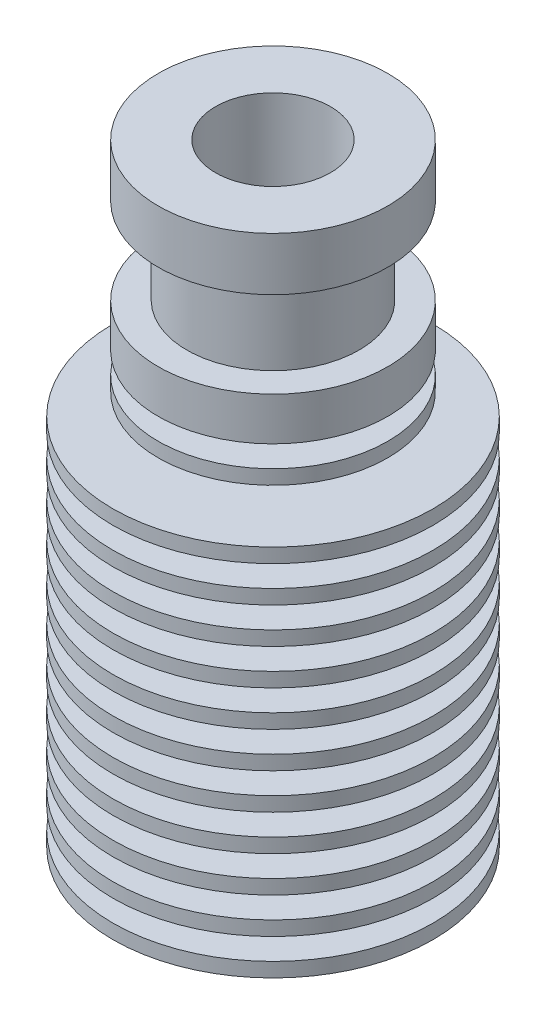
ISO-10303-21;
HEADER;
FILE_DESCRIPTION(('STEP AP214'),'2;1');
FILE_NAME('part.step','',(''),(''),'','','');
FILE_SCHEMA(('AUTOMOTIVE_DESIGN { 1 0 10303 214 1 1 1 1 }'));
ENDSEC;
DATA;
#1=APPLICATION_CONTEXT('core data for automotive mechanical design processes');
#2=APPLICATION_PROTOCOL_DEFINITION('international standard','automotive_design',2000,#1);
#3=PRODUCT_CONTEXT('',#1,'mechanical');
#4=PRODUCT('Part','Part','',(#3));
#5=PRODUCT_RELATED_PRODUCT_CATEGORY('part','',(#4));
#6=PRODUCT_DEFINITION_FORMATION('','',#4);
#7=PRODUCT_DEFINITION_CONTEXT('part definition',#1,'design');
#8=PRODUCT_DEFINITION('design','',#6,#7);
#9=PRODUCT_DEFINITION_SHAPE('','',#8);
#10=(LENGTH_UNIT() NAMED_UNIT(*) SI_UNIT(.MILLI.,.METRE.));
#11=(NAMED_UNIT(*) PLANE_ANGLE_UNIT() SI_UNIT($,.RADIAN.));
#12=(NAMED_UNIT(*) SI_UNIT($,.STERADIAN.) SOLID_ANGLE_UNIT());
#13=UNCERTAINTY_MEASURE_WITH_UNIT(LENGTH_MEASURE(1.E-05),#10,'distance_accuracy_value','');
#14=(GEOMETRIC_REPRESENTATION_CONTEXT(3) GLOBAL_UNCERTAINTY_ASSIGNED_CONTEXT((#13)) GLOBAL_UNIT_ASSIGNED_CONTEXT((#10,
#11,#12)) REPRESENTATION_CONTEXT('',''));
#15=CARTESIAN_POINT('',(0.,0.,0.));
#16=DIRECTION('',(0.,0.,1.));
#17=DIRECTION('',(1.,0.,0.));
#18=AXIS2_PLACEMENT_3D('',#15,#16,#17);
#19=CARTESIAN_POINT('',(-11.2838,17.5,11.2838));
#20=DIRECTION('',(0.,-1.,0.));
#21=DIRECTION('',(0.,0.,-1.));
#22=AXIS2_PLACEMENT_3D('',#19,#20,#21);
#23=PLANE('',#22);
#24=CARTESIAN_POINT('',(0.,17.5,0.));
#25=DIRECTION('',(0.,-1.,0.));
#26=DIRECTION('',(0.,0.,-1.));
#27=AXIS2_PLACEMENT_3D('',#24,#25,#26);
#28=CIRCLE('',#27,5.213883311);
#29=CARTESIAN_POINT('',(0.,17.5,-5.213883311));
#30=VERTEX_POINT('',#29);
#31=EDGE_CURVE('E195',#30,#30,#28,.F.);
#32=ORIENTED_EDGE('',*,*,#31,.T.);
#33=EDGE_LOOP('',(#32));
#34=FACE_BOUND('',#33,.T.);
#35=CARTESIAN_POINT('',(0.,17.5,0.));
#36=DIRECTION('',(0.,-1.,0.));
#37=DIRECTION('',(1.,0.,0.));
#38=AXIS2_PLACEMENT_3D('',#35,#36,#37);
#39=CIRCLE('',#38,11.15);
#40=CARTESIAN_POINT('',(11.15,17.5,0.));
#41=VERTEX_POINT('',#40);
#42=EDGE_CURVE('E18',#41,#41,#39,.T.);
#43=ORIENTED_EDGE('',*,*,#42,.T.);
#44=EDGE_LOOP('',(#43));
#45=FACE_BOUND('',#44,.T.);
#46=ADVANCED_FACE('F14',(#34,#45),#23,.T.);
#47=CARTESIAN_POINT('',(0.,18.5,0.));
#48=DIRECTION('',(0.,-1.,0.));
#49=DIRECTION('',(1.,0.,0.));
#50=AXIS2_PLACEMENT_3D('',#47,#48,#49);
#51=CYLINDRICAL_SURFACE('',#50,11.15);
#52=CARTESIAN_POINT('',(0.,18.5,0.));
#53=DIRECTION('',(0.,-1.,0.));
#54=DIRECTION('',(1.,0.,0.));
#55=AXIS2_PLACEMENT_3D('',#52,#53,#54);
#56=CIRCLE('',#55,11.15);
#57=CARTESIAN_POINT('',(11.15,18.5,0.));
#58=VERTEX_POINT('',#57);
#59=EDGE_CURVE('E193',#58,#58,#56,.F.);
#60=ORIENTED_EDGE('',*,*,#59,.F.);
#61=EDGE_LOOP('',(#60));
#62=FACE_BOUND('',#61,.T.);
#63=ORIENTED_EDGE('',*,*,#42,.F.);
#64=EDGE_LOOP('',(#63));
#65=FACE_BOUND('',#64,.T.);
#66=ADVANCED_FACE('F203',(#62,#65),#51,.T.);
#67=CARTESIAN_POINT('',(0.,17.5,0.));
#68=DIRECTION('',(0.,-1.,0.));
#69=DIRECTION('',(0.,0.,-1.));
#70=AXIS2_PLACEMENT_3D('',#67,#68,#69);
#71=CYLINDRICAL_SURFACE('',#70,5.213883311);
#72=ORIENTED_EDGE('',*,*,#31,.F.);
#73=EDGE_LOOP('',(#72));
#74=FACE_BOUND('',#73,.T.);
#75=CARTESIAN_POINT('',(0.,16.,0.));
#76=DIRECTION('',(0.,-1.,0.));
#77=DIRECTION('',(0.,0.,-1.));
#78=AXIS2_PLACEMENT_3D('',#75,#76,#77);
#79=CIRCLE('',#78,5.213883311);
#80=CARTESIAN_POINT('',(0.,16.,-5.213883311));
#81=VERTEX_POINT('',#80);
#82=EDGE_CURVE('E190',#81,#81,#79,.T.);
#83=ORIENTED_EDGE('',*,*,#82,.F.);
#84=EDGE_LOOP('',(#83));
#85=FACE_BOUND('',#84,.T.);
#86=ADVANCED_FACE('F205',(#74,#85),#71,.T.);
#87=CARTESIAN_POINT('',(-11.2838,18.5,-11.2838));
#88=DIRECTION('',(0.,1.,0.));
#89=DIRECTION('',(0.,0.,1.));
#90=AXIS2_PLACEMENT_3D('',#87,#88,#89);
#91=PLANE('',#90);
#92=CARTESIAN_POINT('',(0.,18.5,0.));
#93=DIRECTION('',(0.,-1.,0.));
#94=DIRECTION('',(1.,0.,0.));
#95=AXIS2_PLACEMENT_3D('',#92,#93,#94);
#96=CIRCLE('',#95,5.082863863);
#97=CARTESIAN_POINT('',(5.082863863,18.5,0.));
#98=VERTEX_POINT('',#97);
#99=EDGE_CURVE('E187',#98,#98,#96,.T.);
#100=ORIENTED_EDGE('',*,*,#99,.T.);
#101=EDGE_LOOP('',(#100));
#102=FACE_BOUND('',#101,.T.);
#103=ORIENTED_EDGE('',*,*,#59,.T.);
#104=EDGE_LOOP('',(#103));
#105=FACE_BOUND('',#104,.T.);
#106=ADVANCED_FACE('F213',(#102,#105),#91,.T.);
#107=CARTESIAN_POINT('',(-11.2838,16.,-11.2838));
#108=DIRECTION('',(0.,1.,0.));
#109=DIRECTION('',(0.,0.,1.));
#110=AXIS2_PLACEMENT_3D('',#107,#108,#109);
#111=PLANE('',#110);
#112=ORIENTED_EDGE('',*,*,#82,.T.);
#113=EDGE_LOOP('',(#112));
#114=FACE_BOUND('',#113,.T.);
#115=CARTESIAN_POINT('',(0.,16.,0.));
#116=DIRECTION('',(0.,-1.,0.));
#117=DIRECTION('',(0.,0.,-1.));
#118=AXIS2_PLACEMENT_3D('',#115,#116,#117);
#119=CIRCLE('',#118,11.15);
#120=CARTESIAN_POINT('',(0.,16.,-11.15));
#121=VERTEX_POINT('',#120);
#122=EDGE_CURVE('E184',#121,#121,#119,.F.);
#123=ORIENTED_EDGE('',*,*,#122,.T.);
#124=EDGE_LOOP('',(#123));
#125=FACE_BOUND('',#124,.T.);
#126=ADVANCED_FACE('F363',(#114,#125),#111,.T.);
#127=CARTESIAN_POINT('',(0.,20.,0.));
#128=DIRECTION('',(0.,-1.,0.));
#129=DIRECTION('',(1.,0.,0.));
#130=AXIS2_PLACEMENT_3D('',#127,#128,#129);
#131=CYLINDRICAL_SURFACE('',#130,5.082863863);
#132=CARTESIAN_POINT('',(0.,20.,0.));
#133=DIRECTION('',(0.,-1.,0.));
#134=DIRECTION('',(1.,0.,0.));
#135=AXIS2_PLACEMENT_3D('',#132,#133,#134);
#136=CIRCLE('',#135,5.082863863);
#137=CARTESIAN_POINT('',(5.082863863,20.,0.));
#138=VERTEX_POINT('',#137);
#139=EDGE_CURVE('E181',#138,#138,#136,.F.);
#140=ORIENTED_EDGE('',*,*,#139,.F.);
#141=EDGE_LOOP('',(#140));
#142=FACE_BOUND('',#141,.T.);
#143=ORIENTED_EDGE('',*,*,#99,.F.);
#144=EDGE_LOOP('',(#143));
#145=FACE_BOUND('',#144,.T.);
#146=ADVANCED_FACE('F360',(#142,#145),#131,.T.);
#147=CARTESIAN_POINT('',(0.,16.,0.));
#148=DIRECTION('',(0.,-1.,0.));
#149=DIRECTION('',(0.,0.,-1.));
#150=AXIS2_PLACEMENT_3D('',#147,#148,#149);
#151=CYLINDRICAL_SURFACE('',#150,11.15);
#152=ORIENTED_EDGE('',*,*,#122,.F.);
#153=EDGE_LOOP('',(#152));
#154=FACE_BOUND('',#153,.T.);
#155=CARTESIAN_POINT('',(0.,15.,0.));
#156=DIRECTION('',(0.,-1.,0.));
#157=DIRECTION('',(0.,0.,-1.));
#158=AXIS2_PLACEMENT_3D('',#155,#156,#157);
#159=CIRCLE('',#158,11.15);
#160=CARTESIAN_POINT('',(0.,15.,-11.15));
#161=VERTEX_POINT('',#160);
#162=EDGE_CURVE('E178',#161,#161,#159,.T.);
#163=ORIENTED_EDGE('',*,*,#162,.F.);
#164=EDGE_LOOP('',(#163));
#165=FACE_BOUND('',#164,.T.);
#166=ADVANCED_FACE('F356',(#154,#165),#151,.T.);
#167=CARTESIAN_POINT('',(-11.2838,20.,11.2838));
#168=DIRECTION('',(0.,-1.,0.));
#169=DIRECTION('',(0.,0.,-1.));
#170=AXIS2_PLACEMENT_3D('',#167,#168,#169);
#171=PLANE('',#170);
#172=ORIENTED_EDGE('',*,*,#139,.T.);
#173=EDGE_LOOP('',(#172));
#174=FACE_BOUND('',#173,.T.);
#175=CARTESIAN_POINT('',(0.,20.,0.));
#176=DIRECTION('',(0.,-1.,0.));
#177=DIRECTION('',(0.,0.,-1.));
#178=AXIS2_PLACEMENT_3D('',#175,#176,#177);
#179=CIRCLE('',#178,11.15);
#180=CARTESIAN_POINT('',(0.,20.,-11.15));
#181=VERTEX_POINT('',#180);
#182=EDGE_CURVE('E175',#181,#181,#179,.T.);
#183=ORIENTED_EDGE('',*,*,#182,.T.);
#184=EDGE_LOOP('',(#183));
#185=FACE_BOUND('',#184,.T.);
#186=ADVANCED_FACE('F359',(#174,#185),#171,.T.);
#187=CARTESIAN_POINT('',(-11.2838,15.,11.2838));
#188=DIRECTION('',(0.,-1.,0.));
#189=DIRECTION('',(0.,0.,-1.));
#190=AXIS2_PLACEMENT_3D('',#187,#188,#189);
#191=PLANE('',#190);
#192=CARTESIAN_POINT('',(0.,15.,0.));
#193=DIRECTION('',(0.,-1.,0.));
#194=DIRECTION('',(1.,0.,0.));
#195=AXIS2_PLACEMENT_3D('',#192,#193,#194);
#196=CIRCLE('',#195,5.344902759);
#197=CARTESIAN_POINT('',(5.344902759,15.,0.));
#198=VERTEX_POINT('',#197);
#199=EDGE_CURVE('E172',#198,#198,#196,.F.);
#200=ORIENTED_EDGE('',*,*,#199,.T.);
#201=EDGE_LOOP('',(#200));
#202=FACE_BOUND('',#201,.T.);
#203=ORIENTED_EDGE('',*,*,#162,.T.);
#204=EDGE_LOOP('',(#203));
#205=FACE_BOUND('',#204,.T.);
#206=ADVANCED_FACE('F354',(#202,#205),#191,.T.);
#207=CARTESIAN_POINT('',(0.,21.,0.));
#208=DIRECTION('',(0.,-1.,0.));
#209=DIRECTION('',(0.,0.,-1.));
#210=AXIS2_PLACEMENT_3D('',#207,#208,#209);
#211=CYLINDRICAL_SURFACE('',#210,11.15);
#212=CARTESIAN_POINT('',(0.,21.,0.));
#213=DIRECTION('',(0.,-1.,0.));
#214=DIRECTION('',(0.,0.,-1.));
#215=AXIS2_PLACEMENT_3D('',#212,#213,#214);
#216=CIRCLE('',#215,11.15);
#217=CARTESIAN_POINT('',(0.,21.,-11.15));
#218=VERTEX_POINT('',#217);
#219=EDGE_CURVE('E169',#218,#218,#216,.F.);
#220=ORIENTED_EDGE('',*,*,#219,.F.);
#221=EDGE_LOOP('',(#220));
#222=FACE_BOUND('',#221,.T.);
#223=ORIENTED_EDGE('',*,*,#182,.F.);
#224=EDGE_LOOP('',(#223));
#225=FACE_BOUND('',#224,.T.);
#226=ADVANCED_FACE('F350',(#222,#225),#211,.T.);
#227=CARTESIAN_POINT('',(0.,15.,0.));
#228=DIRECTION('',(0.,-1.,0.));
#229=DIRECTION('',(1.,0.,0.));
#230=AXIS2_PLACEMENT_3D('',#227,#228,#229);
#231=CYLINDRICAL_SURFACE('',#230,5.344902759);
#232=ORIENTED_EDGE('',*,*,#199,.F.);
#233=EDGE_LOOP('',(#232));
#234=FACE_BOUND('',#233,.T.);
#235=CARTESIAN_POINT('',(0.,13.5,0.));
#236=DIRECTION('',(0.,-1.,0.));
#237=DIRECTION('',(1.,0.,0.));
#238=AXIS2_PLACEMENT_3D('',#235,#236,#237);
#239=CIRCLE('',#238,5.344902759);
#240=CARTESIAN_POINT('',(5.344902759,13.5,0.));
#241=VERTEX_POINT('',#240);
#242=EDGE_CURVE('E166',#241,#241,#239,.T.);
#243=ORIENTED_EDGE('',*,*,#242,.F.);
#244=EDGE_LOOP('',(#243));
#245=FACE_BOUND('',#244,.T.);
#246=ADVANCED_FACE('F346',(#234,#245),#231,.T.);
#247=CARTESIAN_POINT('',(-11.2838,21.,-11.2838));
#248=DIRECTION('',(0.,1.,0.));
#249=DIRECTION('',(0.,0.,1.));
#250=AXIS2_PLACEMENT_3D('',#247,#248,#249);
#251=PLANE('',#250);
#252=CARTESIAN_POINT('',(0.,21.,0.));
#253=DIRECTION('',(0.,-1.,0.));
#254=DIRECTION('',(0.,0.,-1.));
#255=AXIS2_PLACEMENT_3D('',#252,#253,#254);
#256=CIRCLE('',#255,4.951844414);
#257=CARTESIAN_POINT('',(0.,21.,-4.951844414));
#258=VERTEX_POINT('',#257);
#259=EDGE_CURVE('E163',#258,#258,#256,.T.);
#260=ORIENTED_EDGE('',*,*,#259,.T.);
#261=EDGE_LOOP('',(#260));
#262=FACE_BOUND('',#261,.T.);
#263=ORIENTED_EDGE('',*,*,#219,.T.);
#264=EDGE_LOOP('',(#263));
#265=FACE_BOUND('',#264,.T.);
#266=ADVANCED_FACE('F349',(#262,#265),#251,.T.);
#267=CARTESIAN_POINT('',(-11.2838,13.5,-11.2838));
#268=DIRECTION('',(0.,1.,0.));
#269=DIRECTION('',(0.,0.,1.));
#270=AXIS2_PLACEMENT_3D('',#267,#268,#269);
#271=PLANE('',#270);
#272=ORIENTED_EDGE('',*,*,#242,.T.);
#273=EDGE_LOOP('',(#272));
#274=FACE_BOUND('',#273,.T.);
#275=CARTESIAN_POINT('',(0.,13.5,0.));
#276=DIRECTION('',(0.,-1.,0.));
#277=DIRECTION('',(1.,0.,0.));
#278=AXIS2_PLACEMENT_3D('',#275,#276,#277);
#279=CIRCLE('',#278,11.15);
#280=CARTESIAN_POINT('',(11.15,13.5,0.));
#281=VERTEX_POINT('',#280);
#282=EDGE_CURVE('E160',#281,#281,#279,.F.);
#283=ORIENTED_EDGE('',*,*,#282,.T.);
#284=EDGE_LOOP('',(#283));
#285=FACE_BOUND('',#284,.T.);
#286=ADVANCED_FACE('F344',(#274,#285),#271,.T.);
#287=CARTESIAN_POINT('',(0.,22.5,0.));
#288=DIRECTION('',(0.,-1.,0.));
#289=DIRECTION('',(0.,0.,-1.));
#290=AXIS2_PLACEMENT_3D('',#287,#288,#289);
#291=CYLINDRICAL_SURFACE('',#290,4.951844414);
#292=CARTESIAN_POINT('',(0.,22.5,0.));
#293=DIRECTION('',(0.,-1.,0.));
#294=DIRECTION('',(0.,0.,-1.));
#295=AXIS2_PLACEMENT_3D('',#292,#293,#294);
#296=CIRCLE('',#295,4.951844414);
#297=CARTESIAN_POINT('',(0.,22.5,-4.951844414));
#298=VERTEX_POINT('',#297);
#299=EDGE_CURVE('E157',#298,#298,#296,.F.);
#300=ORIENTED_EDGE('',*,*,#299,.F.);
#301=EDGE_LOOP('',(#300));
#302=FACE_BOUND('',#301,.T.);
#303=ORIENTED_EDGE('',*,*,#259,.F.);
#304=EDGE_LOOP('',(#303));
#305=FACE_BOUND('',#304,.T.);
#306=ADVANCED_FACE('F340',(#302,#305),#291,.T.);
#307=CARTESIAN_POINT('',(0.,13.5,0.));
#308=DIRECTION('',(0.,-1.,0.));
#309=DIRECTION('',(1.,0.,0.));
#310=AXIS2_PLACEMENT_3D('',#307,#308,#309);
#311=CYLINDRICAL_SURFACE('',#310,11.15);
#312=ORIENTED_EDGE('',*,*,#282,.F.);
#313=EDGE_LOOP('',(#312));
#314=FACE_BOUND('',#313,.T.);
#315=CARTESIAN_POINT('',(0.,12.5,0.));
#316=DIRECTION('',(0.,-1.,0.));
#317=DIRECTION('',(1.,0.,0.));
#318=AXIS2_PLACEMENT_3D('',#315,#316,#317);
#319=CIRCLE('',#318,11.15);
#320=CARTESIAN_POINT('',(11.15,12.5,0.));
#321=VERTEX_POINT('',#320);
#322=EDGE_CURVE('E154',#321,#321,#319,.T.);
#323=ORIENTED_EDGE('',*,*,#322,.F.);
#324=EDGE_LOOP('',(#323));
#325=FACE_BOUND('',#324,.T.);
#326=ADVANCED_FACE('F336',(#314,#325),#311,.T.);
#327=CARTESIAN_POINT('',(-11.2838,22.5,11.2838));
#328=DIRECTION('',(0.,-1.,0.));
#329=DIRECTION('',(0.,0.,-1.));
#330=AXIS2_PLACEMENT_3D('',#327,#328,#329);
#331=PLANE('',#330);
#332=ORIENTED_EDGE('',*,*,#299,.T.);
#333=EDGE_LOOP('',(#332));
#334=FACE_BOUND('',#333,.T.);
#335=CARTESIAN_POINT('',(0.,22.5,0.));
#336=DIRECTION('',(0.,-1.,0.));
#337=DIRECTION('',(0.,0.,-1.));
#338=AXIS2_PLACEMENT_3D('',#335,#336,#337);
#339=CIRCLE('',#338,11.15);
#340=CARTESIAN_POINT('',(0.,22.5,-11.15));
#341=VERTEX_POINT('',#340);
#342=EDGE_CURVE('E151',#341,#341,#339,.T.);
#343=ORIENTED_EDGE('',*,*,#342,.T.);
#344=EDGE_LOOP('',(#343));
#345=FACE_BOUND('',#344,.T.);
#346=ADVANCED_FACE('F339',(#334,#345),#331,.T.);
#347=CARTESIAN_POINT('',(-11.2838,12.5,11.2838));
#348=DIRECTION('',(0.,-1.,0.));
#349=DIRECTION('',(0.,0.,-1.));
#350=AXIS2_PLACEMENT_3D('',#347,#348,#349);
#351=PLANE('',#350);
#352=CARTESIAN_POINT('',(0.,12.5,0.));
#353=DIRECTION('',(0.,-1.,0.));
#354=DIRECTION('',(0.,0.,-1.));
#355=AXIS2_PLACEMENT_3D('',#352,#353,#354);
#356=CIRCLE('',#355,5.475922207);
#357=CARTESIAN_POINT('',(0.,12.5,-5.475922207));
#358=VERTEX_POINT('',#357);
#359=EDGE_CURVE('E148',#358,#358,#356,.F.);
#360=ORIENTED_EDGE('',*,*,#359,.T.);
#361=EDGE_LOOP('',(#360));
#362=FACE_BOUND('',#361,.T.);
#363=ORIENTED_EDGE('',*,*,#322,.T.);
#364=EDGE_LOOP('',(#363));
#365=FACE_BOUND('',#364,.T.);
#366=ADVANCED_FACE('F334',(#362,#365),#351,.T.);
#367=CARTESIAN_POINT('',(0.,23.5,0.));
#368=DIRECTION('',(0.,-1.,0.));
#369=DIRECTION('',(0.,0.,-1.));
#370=AXIS2_PLACEMENT_3D('',#367,#368,#369);
#371=CYLINDRICAL_SURFACE('',#370,11.15);
#372=CARTESIAN_POINT('',(0.,23.5,0.));
#373=DIRECTION('',(0.,-1.,0.));
#374=DIRECTION('',(0.,0.,-1.));
#375=AXIS2_PLACEMENT_3D('',#372,#373,#374);
#376=CIRCLE('',#375,11.15);
#377=CARTESIAN_POINT('',(0.,23.5,-11.15));
#378=VERTEX_POINT('',#377);
#379=EDGE_CURVE('E145',#378,#378,#376,.F.);
#380=ORIENTED_EDGE('',*,*,#379,.F.);
#381=EDGE_LOOP('',(#380));
#382=FACE_BOUND('',#381,.T.);
#383=ORIENTED_EDGE('',*,*,#342,.F.);
#384=EDGE_LOOP('',(#383));
#385=FACE_BOUND('',#384,.T.);
#386=ADVANCED_FACE('F330',(#382,#385),#371,.T.);
#387=CARTESIAN_POINT('',(0.,12.5,0.));
#388=DIRECTION('',(0.,-1.,0.));
#389=DIRECTION('',(0.,0.,-1.));
#390=AXIS2_PLACEMENT_3D('',#387,#388,#389);
#391=CYLINDRICAL_SURFACE('',#390,5.475922207);
#392=ORIENTED_EDGE('',*,*,#359,.F.);
#393=EDGE_LOOP('',(#392));
#394=FACE_BOUND('',#393,.T.);
#395=CARTESIAN_POINT('',(0.,11.,0.));
#396=DIRECTION('',(0.,-1.,0.));
#397=DIRECTION('',(0.,0.,-1.));
#398=AXIS2_PLACEMENT_3D('',#395,#396,#397);
#399=CIRCLE('',#398,5.475922207);
#400=CARTESIAN_POINT('',(0.,11.,-5.475922207));
#401=VERTEX_POINT('',#400);
#402=EDGE_CURVE('E142',#401,#401,#399,.T.);
#403=ORIENTED_EDGE('',*,*,#402,.F.);
#404=EDGE_LOOP('',(#403));
#405=FACE_BOUND('',#404,.T.);
#406=ADVANCED_FACE('F326',(#394,#405),#391,.T.);
#407=CARTESIAN_POINT('',(-11.2838,23.5,-11.2838));
#408=DIRECTION('',(0.,1.,0.));
#409=DIRECTION('',(0.,0.,1.));
#410=AXIS2_PLACEMENT_3D('',#407,#408,#409);
#411=PLANE('',#410);
#412=CARTESIAN_POINT('',(0.,23.5,0.));
#413=DIRECTION('',(0.,-1.,0.));
#414=DIRECTION('',(0.,0.,-1.));
#415=AXIS2_PLACEMENT_3D('',#412,#413,#414);
#416=CIRCLE('',#415,4.820824966);
#417=CARTESIAN_POINT('',(0.,23.5,-4.820824966));
#418=VERTEX_POINT('',#417);
#419=EDGE_CURVE('E139',#418,#418,#416,.T.);
#420=ORIENTED_EDGE('',*,*,#419,.T.);
#421=EDGE_LOOP('',(#420));
#422=FACE_BOUND('',#421,.T.);
#423=ORIENTED_EDGE('',*,*,#379,.T.);
#424=EDGE_LOOP('',(#423));
#425=FACE_BOUND('',#424,.T.);
#426=ADVANCED_FACE('F329',(#422,#425),#411,.T.);
#427=CARTESIAN_POINT('',(-11.2838,11.,-11.2838));
#428=DIRECTION('',(0.,1.,0.));
#429=DIRECTION('',(0.,0.,1.));
#430=AXIS2_PLACEMENT_3D('',#427,#428,#429);
#431=PLANE('',#430);
#432=ORIENTED_EDGE('',*,*,#402,.T.);
#433=EDGE_LOOP('',(#432));
#434=FACE_BOUND('',#433,.T.);
#435=CARTESIAN_POINT('',(0.,11.,0.));
#436=DIRECTION('',(0.,-1.,0.));
#437=DIRECTION('',(0.,0.,-1.));
#438=AXIS2_PLACEMENT_3D('',#435,#436,#437);
#439=CIRCLE('',#438,11.15);
#440=CARTESIAN_POINT('',(0.,11.,-11.15));
#441=VERTEX_POINT('',#440);
#442=EDGE_CURVE('E136',#441,#441,#439,.F.);
#443=ORIENTED_EDGE('',*,*,#442,.T.);
#444=EDGE_LOOP('',(#443));
#445=FACE_BOUND('',#444,.T.);
#446=ADVANCED_FACE('F324',(#434,#445),#431,.T.);
#447=CARTESIAN_POINT('',(0.,25.,0.));
#448=DIRECTION('',(0.,-1.,0.));
#449=DIRECTION('',(0.,0.,-1.));
#450=AXIS2_PLACEMENT_3D('',#447,#448,#449);
#451=CYLINDRICAL_SURFACE('',#450,4.820824966);
#452=CARTESIAN_POINT('',(0.,25.,0.));
#453=DIRECTION('',(0.,-1.,0.));
#454=DIRECTION('',(0.,0.,-1.));
#455=AXIS2_PLACEMENT_3D('',#452,#453,#454);
#456=CIRCLE('',#455,4.820824966);
#457=CARTESIAN_POINT('',(0.,25.,-4.820824966));
#458=VERTEX_POINT('',#457);
#459=EDGE_CURVE('E133',#458,#458,#456,.F.);
#460=ORIENTED_EDGE('',*,*,#459,.F.);
#461=EDGE_LOOP('',(#460));
#462=FACE_BOUND('',#461,.T.);
#463=ORIENTED_EDGE('',*,*,#419,.F.);
#464=EDGE_LOOP('',(#463));
#465=FACE_BOUND('',#464,.T.);
#466=ADVANCED_FACE('F320',(#462,#465),#451,.T.);
#467=CARTESIAN_POINT('',(0.,11.,0.));
#468=DIRECTION('',(0.,-1.,0.));
#469=DIRECTION('',(0.,0.,-1.));
#470=AXIS2_PLACEMENT_3D('',#467,#468,#469);
#471=CYLINDRICAL_SURFACE('',#470,11.15);
#472=ORIENTED_EDGE('',*,*,#442,.F.);
#473=EDGE_LOOP('',(#472));
#474=FACE_BOUND('',#473,.T.);
#475=CARTESIAN_POINT('',(0.,10.,0.));
#476=DIRECTION('',(0.,-1.,0.));
#477=DIRECTION('',(0.,0.,-1.));
#478=AXIS2_PLACEMENT_3D('',#475,#476,#477);
#479=CIRCLE('',#478,11.15);
#480=CARTESIAN_POINT('',(0.,10.,-11.15));
#481=VERTEX_POINT('',#480);
#482=EDGE_CURVE('E130',#481,#481,#479,.T.);
#483=ORIENTED_EDGE('',*,*,#482,.F.);
#484=EDGE_LOOP('',(#483));
#485=FACE_BOUND('',#484,.T.);
#486=ADVANCED_FACE('F316',(#474,#485),#471,.T.);
#487=CARTESIAN_POINT('',(-11.2838,25.,11.2838));
#488=DIRECTION('',(0.,-1.,0.));
#489=DIRECTION('',(0.,0.,-1.));
#490=AXIS2_PLACEMENT_3D('',#487,#488,#489);
#491=PLANE('',#490);
#492=ORIENTED_EDGE('',*,*,#459,.T.);
#493=EDGE_LOOP('',(#492));
#494=FACE_BOUND('',#493,.T.);
#495=CARTESIAN_POINT('',(0.,25.,0.));
#496=DIRECTION('',(0.,-1.,0.));
#497=DIRECTION('',(1.,0.,0.));
#498=AXIS2_PLACEMENT_3D('',#495,#496,#497);
#499=CIRCLE('',#498,11.15);
#500=CARTESIAN_POINT('',(11.15,25.,0.));
#501=VERTEX_POINT('',#500);
#502=EDGE_CURVE('E127',#501,#501,#499,.T.);
#503=ORIENTED_EDGE('',*,*,#502,.T.);
#504=EDGE_LOOP('',(#503));
#505=FACE_BOUND('',#504,.T.);
#506=ADVANCED_FACE('F319',(#494,#505),#491,.T.);
#507=CARTESIAN_POINT('',(-11.2838,10.,11.2838));
#508=DIRECTION('',(0.,-1.,0.));
#509=DIRECTION('',(0.,0.,-1.));
#510=AXIS2_PLACEMENT_3D('',#507,#508,#509);
#511=PLANE('',#510);
#512=CARTESIAN_POINT('',(0.,10.,0.));
#513=DIRECTION('',(0.,-1.,0.));
#514=DIRECTION('',(1.,0.,0.));
#515=AXIS2_PLACEMENT_3D('',#512,#513,#514);
#516=CIRCLE('',#515,5.606941655);
#517=CARTESIAN_POINT('',(5.606941655,10.,0.));
#518=VERTEX_POINT('',#517);
#519=EDGE_CURVE('E124',#518,#518,#516,.F.);
#520=ORIENTED_EDGE('',*,*,#519,.T.);
#521=EDGE_LOOP('',(#520));
#522=FACE_BOUND('',#521,.T.);
#523=ORIENTED_EDGE('',*,*,#482,.T.);
#524=EDGE_LOOP('',(#523));
#525=FACE_BOUND('',#524,.T.);
#526=ADVANCED_FACE('F314',(#522,#525),#511,.T.);
#527=CARTESIAN_POINT('',(0.,26.,0.));
#528=DIRECTION('',(0.,-1.,0.));
#529=DIRECTION('',(1.,0.,0.));
#530=AXIS2_PLACEMENT_3D('',#527,#528,#529);
#531=CYLINDRICAL_SURFACE('',#530,11.15);
#532=CARTESIAN_POINT('',(0.,26.,0.));
#533=DIRECTION('',(0.,-1.,0.));
#534=DIRECTION('',(1.,0.,0.));
#535=AXIS2_PLACEMENT_3D('',#532,#533,#534);
#536=CIRCLE('',#535,11.15);
#537=CARTESIAN_POINT('',(11.15,26.,0.));
#538=VERTEX_POINT('',#537);
#539=EDGE_CURVE('E121',#538,#538,#536,.F.);
#540=ORIENTED_EDGE('',*,*,#539,.F.);
#541=EDGE_LOOP('',(#540));
#542=FACE_BOUND('',#541,.T.);
#543=ORIENTED_EDGE('',*,*,#502,.F.);
#544=EDGE_LOOP('',(#543));
#545=FACE_BOUND('',#544,.T.);
#546=ADVANCED_FACE('F310',(#542,#545),#531,.T.);
#547=CARTESIAN_POINT('',(0.,10.,0.));
#548=DIRECTION('',(0.,-1.,0.));
#549=DIRECTION('',(1.,0.,0.));
#550=AXIS2_PLACEMENT_3D('',#547,#548,#549);
#551=CYLINDRICAL_SURFACE('',#550,5.606941655);
#552=ORIENTED_EDGE('',*,*,#519,.F.);
#553=EDGE_LOOP('',(#552));
#554=FACE_BOUND('',#553,.T.);
#555=CARTESIAN_POINT('',(0.,8.5,0.));
#556=DIRECTION('',(0.,-1.,0.));
#557=DIRECTION('',(1.,0.,0.));
#558=AXIS2_PLACEMENT_3D('',#555,#556,#557);
#559=CIRCLE('',#558,5.606941655);
#560=CARTESIAN_POINT('',(5.606941655,8.5,0.));
#561=VERTEX_POINT('',#560);
#562=EDGE_CURVE('E118',#561,#561,#559,.T.);
#563=ORIENTED_EDGE('',*,*,#562,.F.);
#564=EDGE_LOOP('',(#563));
#565=FACE_BOUND('',#564,.T.);
#566=ADVANCED_FACE('F306',(#554,#565),#551,.T.);
#567=CARTESIAN_POINT('',(-11.2838,26.,-11.2838));
#568=DIRECTION('',(0.,1.,0.));
#569=DIRECTION('',(0.,0.,1.));
#570=AXIS2_PLACEMENT_3D('',#567,#568,#569);
#571=PLANE('',#570);
#572=CARTESIAN_POINT('',(0.,26.,0.));
#573=DIRECTION('',(0.,-1.,0.));
#574=DIRECTION('',(0.,0.,-1.));
#575=AXIS2_PLACEMENT_3D('',#572,#573,#574);
#576=CIRCLE('',#575,4.689805518);
#577=CARTESIAN_POINT('',(0.,26.,-4.689805518));
#578=VERTEX_POINT('',#577);
#579=EDGE_CURVE('E115',#578,#578,#576,.T.);
#580=ORIENTED_EDGE('',*,*,#579,.T.);
#581=EDGE_LOOP('',(#580));
#582=FACE_BOUND('',#581,.T.);
#583=ORIENTED_EDGE('',*,*,#539,.T.);
#584=EDGE_LOOP('',(#583));
#585=FACE_BOUND('',#584,.T.);
#586=ADVANCED_FACE('F309',(#582,#585),#571,.T.);
#587=CARTESIAN_POINT('',(-11.2838,8.5,-11.2838));
#588=DIRECTION('',(0.,1.,0.));
#589=DIRECTION('',(0.,0.,1.));
#590=AXIS2_PLACEMENT_3D('',#587,#588,#589);
#591=PLANE('',#590);
#592=ORIENTED_EDGE('',*,*,#562,.T.);
#593=EDGE_LOOP('',(#592));
#594=FACE_BOUND('',#593,.T.);
#595=CARTESIAN_POINT('',(0.,8.5,0.));
#596=DIRECTION('',(0.,-1.,0.));
#597=DIRECTION('',(0.,0.,-1.));
#598=AXIS2_PLACEMENT_3D('',#595,#596,#597);
#599=CIRCLE('',#598,11.15);
#600=CARTESIAN_POINT('',(0.,8.5,-11.15));
#601=VERTEX_POINT('',#600);
#602=EDGE_CURVE('E112',#601,#601,#599,.F.);
#603=ORIENTED_EDGE('',*,*,#602,.T.);
#604=EDGE_LOOP('',(#603));
#605=FACE_BOUND('',#604,.T.);
#606=ADVANCED_FACE('F304',(#594,#605),#591,.T.);
#607=CARTESIAN_POINT('',(0.,27.5,0.));
#608=DIRECTION('',(0.,-1.,0.));
#609=DIRECTION('',(0.,0.,-1.));
#610=AXIS2_PLACEMENT_3D('',#607,#608,#609);
#611=CYLINDRICAL_SURFACE('',#610,4.689805518);
#612=CARTESIAN_POINT('',(0.,27.5,0.));
#613=DIRECTION('',(0.,-1.,0.));
#614=DIRECTION('',(0.,0.,-1.));
#615=AXIS2_PLACEMENT_3D('',#612,#613,#614);
#616=CIRCLE('',#615,4.689805518);
#617=CARTESIAN_POINT('',(0.,27.5,-4.689805518));
#618=VERTEX_POINT('',#617);
#619=EDGE_CURVE('E109',#618,#618,#616,.F.);
#620=ORIENTED_EDGE('',*,*,#619,.F.);
#621=EDGE_LOOP('',(#620));
#622=FACE_BOUND('',#621,.T.);
#623=ORIENTED_EDGE('',*,*,#579,.F.);
#624=EDGE_LOOP('',(#623));
#625=FACE_BOUND('',#624,.T.);
#626=ADVANCED_FACE('F300',(#622,#625),#611,.T.);
#627=CARTESIAN_POINT('',(0.,8.5,0.));
#628=DIRECTION('',(0.,-1.,0.));
#629=DIRECTION('',(0.,0.,-1.));
#630=AXIS2_PLACEMENT_3D('',#627,#628,#629);
#631=CYLINDRICAL_SURFACE('',#630,11.15);
#632=ORIENTED_EDGE('',*,*,#602,.F.);
#633=EDGE_LOOP('',(#632));
#634=FACE_BOUND('',#633,.T.);
#635=CARTESIAN_POINT('',(0.,7.5,0.));
#636=DIRECTION('',(0.,-1.,0.));
#637=DIRECTION('',(0.,0.,-1.));
#638=AXIS2_PLACEMENT_3D('',#635,#636,#637);
#639=CIRCLE('',#638,11.15);
#640=CARTESIAN_POINT('',(0.,7.5,-11.15));
#641=VERTEX_POINT('',#640);
#642=EDGE_CURVE('E106',#641,#641,#639,.T.);
#643=ORIENTED_EDGE('',*,*,#642,.F.);
#644=EDGE_LOOP('',(#643));
#645=FACE_BOUND('',#644,.T.);
#646=ADVANCED_FACE('F296',(#634,#645),#631,.T.);
#647=CARTESIAN_POINT('',(-8.096,27.5,8.096));
#648=DIRECTION('',(0.,-1.,0.));
#649=DIRECTION('',(0.,0.,-1.));
#650=AXIS2_PLACEMENT_3D('',#647,#648,#649);
#651=PLANE('',#650);
#652=ORIENTED_EDGE('',*,*,#619,.T.);
#653=EDGE_LOOP('',(#652));
#654=FACE_BOUND('',#653,.T.);
#655=CARTESIAN_POINT('',(0.,27.5,0.));
#656=DIRECTION('',(0.,-1.,0.));
#657=DIRECTION('',(1.,0.,0.));
#658=AXIS2_PLACEMENT_3D('',#655,#656,#657);
#659=CIRCLE('',#658,8.);
#660=CARTESIAN_POINT('',(8.,27.5,0.));
#661=VERTEX_POINT('',#660);
#662=EDGE_CURVE('E103',#661,#661,#659,.T.);
#663=ORIENTED_EDGE('',*,*,#662,.T.);
#664=EDGE_LOOP('',(#663));
#665=FACE_BOUND('',#664,.T.);
#666=ADVANCED_FACE('F299',(#654,#665),#651,.T.);
#667=CARTESIAN_POINT('',(-11.2838,7.5,11.2838));
#668=DIRECTION('',(0.,-1.,0.));
#669=DIRECTION('',(0.,0.,-1.));
#670=AXIS2_PLACEMENT_3D('',#667,#668,#669);
#671=PLANE('',#670);
#672=CARTESIAN_POINT('',(0.,7.5,0.));
#673=DIRECTION('',(0.,-1.,0.));
#674=DIRECTION('',(1.,0.,0.));
#675=AXIS2_PLACEMENT_3D('',#672,#673,#674);
#676=CIRCLE('',#675,5.737961104);
#677=CARTESIAN_POINT('',(5.737961104,7.5,0.));
#678=VERTEX_POINT('',#677);
#679=EDGE_CURVE('E100',#678,#678,#676,.F.);
#680=ORIENTED_EDGE('',*,*,#679,.T.);
#681=EDGE_LOOP('',(#680));
#682=FACE_BOUND('',#681,.T.);
#683=ORIENTED_EDGE('',*,*,#642,.T.);
#684=EDGE_LOOP('',(#683));
#685=FACE_BOUND('',#684,.T.);
#686=ADVANCED_FACE('F294',(#682,#685),#671,.T.);
#687=CARTESIAN_POINT('',(0.,28.5,0.));
#688=DIRECTION('',(0.,-1.,0.));
#689=DIRECTION('',(1.,0.,0.));
#690=AXIS2_PLACEMENT_3D('',#687,#688,#689);
#691=CYLINDRICAL_SURFACE('',#690,8.);
#692=CARTESIAN_POINT('',(0.,28.5,0.));
#693=DIRECTION('',(0.,-1.,0.));
#694=DIRECTION('',(1.,0.,0.));
#695=AXIS2_PLACEMENT_3D('',#692,#693,#694);
#696=CIRCLE('',#695,8.);
#697=CARTESIAN_POINT('',(8.,28.5,0.));
#698=VERTEX_POINT('',#697);
#699=EDGE_CURVE('E97',#698,#698,#696,.F.);
#700=ORIENTED_EDGE('',*,*,#699,.F.);
#701=EDGE_LOOP('',(#700));
#702=FACE_BOUND('',#701,.T.);
#703=ORIENTED_EDGE('',*,*,#662,.F.);
#704=EDGE_LOOP('',(#703));
#705=FACE_BOUND('',#704,.T.);
#706=ADVANCED_FACE('F290',(#702,#705),#691,.T.);
#707=CARTESIAN_POINT('',(0.,7.5,0.));
#708=DIRECTION('',(0.,-1.,0.));
#709=DIRECTION('',(1.,0.,0.));
#710=AXIS2_PLACEMENT_3D('',#707,#708,#709);
#711=CYLINDRICAL_SURFACE('',#710,5.737961104);
#712=ORIENTED_EDGE('',*,*,#679,.F.);
#713=EDGE_LOOP('',(#712));
#714=FACE_BOUND('',#713,.T.);
#715=CARTESIAN_POINT('',(0.,6.,0.));
#716=DIRECTION('',(0.,-1.,0.));
#717=DIRECTION('',(1.,0.,0.));
#718=AXIS2_PLACEMENT_3D('',#715,#716,#717);
#719=CIRCLE('',#718,5.737961104);
#720=CARTESIAN_POINT('',(5.737961104,6.,0.));
#721=VERTEX_POINT('',#720);
#722=EDGE_CURVE('E94',#721,#721,#719,.T.);
#723=ORIENTED_EDGE('',*,*,#722,.F.);
#724=EDGE_LOOP('',(#723));
#725=FACE_BOUND('',#724,.T.);
#726=ADVANCED_FACE('F286',(#714,#725),#711,.T.);
#727=CARTESIAN_POINT('',(-8.096,28.5,-8.096));
#728=DIRECTION('',(0.,1.,0.));
#729=DIRECTION('',(0.,0.,1.));
#730=AXIS2_PLACEMENT_3D('',#727,#728,#729);
#731=PLANE('',#730);
#732=CARTESIAN_POINT('',(0.,28.5,0.));
#733=DIRECTION('',(0.,-1.,0.));
#734=DIRECTION('',(1.,0.,0.));
#735=AXIS2_PLACEMENT_3D('',#732,#733,#734);
#736=CIRCLE('',#735,4.689805518);
#737=CARTESIAN_POINT('',(4.689805518,28.5,0.));
#738=VERTEX_POINT('',#737);
#739=EDGE_CURVE('E91',#738,#738,#736,.T.);
#740=ORIENTED_EDGE('',*,*,#739,.T.);
#741=EDGE_LOOP('',(#740));
#742=FACE_BOUND('',#741,.T.);
#743=ORIENTED_EDGE('',*,*,#699,.T.);
#744=EDGE_LOOP('',(#743));
#745=FACE_BOUND('',#744,.T.);
#746=ADVANCED_FACE('F289',(#742,#745),#731,.T.);
#747=CARTESIAN_POINT('',(-11.2838,6.,-11.2838));
#748=DIRECTION('',(0.,1.,0.));
#749=DIRECTION('',(0.,0.,1.));
#750=AXIS2_PLACEMENT_3D('',#747,#748,#749);
#751=PLANE('',#750);
#752=ORIENTED_EDGE('',*,*,#722,.T.);
#753=EDGE_LOOP('',(#752));
#754=FACE_BOUND('',#753,.T.);
#755=CARTESIAN_POINT('',(0.,6.,0.));
#756=DIRECTION('',(0.,-1.,0.));
#757=DIRECTION('',(0.,0.,-1.));
#758=AXIS2_PLACEMENT_3D('',#755,#756,#757);
#759=CIRCLE('',#758,11.15);
#760=CARTESIAN_POINT('',(0.,6.,-11.15));
#761=VERTEX_POINT('',#760);
#762=EDGE_CURVE('E88',#761,#761,#759,.F.);
#763=ORIENTED_EDGE('',*,*,#762,.T.);
#764=EDGE_LOOP('',(#763));
#765=FACE_BOUND('',#764,.T.);
#766=ADVANCED_FACE('F284',(#754,#765),#751,.T.);
#767=CARTESIAN_POINT('',(0.,30.,0.));
#768=DIRECTION('',(0.,-1.,0.));
#769=DIRECTION('',(1.,0.,0.));
#770=AXIS2_PLACEMENT_3D('',#767,#768,#769);
#771=CYLINDRICAL_SURFACE('',#770,4.689805518);
#772=CARTESIAN_POINT('',(0.,30.,0.));
#773=DIRECTION('',(0.,-1.,0.));
#774=DIRECTION('',(1.,0.,0.));
#775=AXIS2_PLACEMENT_3D('',#772,#773,#774);
#776=CIRCLE('',#775,4.689805518);
#777=CARTESIAN_POINT('',(4.689805518,30.,0.));
#778=VERTEX_POINT('',#777);
#779=EDGE_CURVE('E85',#778,#778,#776,.F.);
#780=ORIENTED_EDGE('',*,*,#779,.F.);
#781=EDGE_LOOP('',(#780));
#782=FACE_BOUND('',#781,.T.);
#783=ORIENTED_EDGE('',*,*,#739,.F.);
#784=EDGE_LOOP('',(#783));
#785=FACE_BOUND('',#784,.T.);
#786=ADVANCED_FACE('F280',(#782,#785),#771,.T.);
#787=CARTESIAN_POINT('',(0.,6.,0.));
#788=DIRECTION('',(0.,-1.,0.));
#789=DIRECTION('',(0.,0.,-1.));
#790=AXIS2_PLACEMENT_3D('',#787,#788,#789);
#791=CYLINDRICAL_SURFACE('',#790,11.15);
#792=ORIENTED_EDGE('',*,*,#762,.F.);
#793=EDGE_LOOP('',(#792));
#794=FACE_BOUND('',#793,.T.);
#795=CARTESIAN_POINT('',(0.,5.,0.));
#796=DIRECTION('',(0.,-1.,0.));
#797=DIRECTION('',(0.,0.,-1.));
#798=AXIS2_PLACEMENT_3D('',#795,#796,#797);
#799=CIRCLE('',#798,11.15);
#800=CARTESIAN_POINT('',(0.,5.,-11.15));
#801=VERTEX_POINT('',#800);
#802=EDGE_CURVE('E82',#801,#801,#799,.T.);
#803=ORIENTED_EDGE('',*,*,#802,.F.);
#804=EDGE_LOOP('',(#803));
#805=FACE_BOUND('',#804,.T.);
#806=ADVANCED_FACE('F276',(#794,#805),#791,.T.);
#807=CARTESIAN_POINT('',(-8.096,30.,8.096));
#808=DIRECTION('',(0.,-1.,0.));
#809=DIRECTION('',(0.,0.,-1.));
#810=AXIS2_PLACEMENT_3D('',#807,#808,#809);
#811=PLANE('',#810);
#812=ORIENTED_EDGE('',*,*,#779,.T.);
#813=EDGE_LOOP('',(#812));
#814=FACE_BOUND('',#813,.T.);
#815=CARTESIAN_POINT('',(0.,30.,0.));
#816=DIRECTION('',(0.,-1.,0.));
#817=DIRECTION('',(0.,0.,-1.));
#818=AXIS2_PLACEMENT_3D('',#815,#816,#817);
#819=CIRCLE('',#818,8.);
#820=CARTESIAN_POINT('',(0.,30.,-8.));
#821=VERTEX_POINT('',#820);
#822=EDGE_CURVE('E79',#821,#821,#819,.T.);
#823=ORIENTED_EDGE('',*,*,#822,.T.);
#824=EDGE_LOOP('',(#823));
#825=FACE_BOUND('',#824,.T.);
#826=ADVANCED_FACE('F279',(#814,#825),#811,.T.);
#827=CARTESIAN_POINT('',(-11.2838,5.,11.2838));
#828=DIRECTION('',(0.,-1.,0.));
#829=DIRECTION('',(0.,0.,-1.));
#830=AXIS2_PLACEMENT_3D('',#827,#828,#829);
#831=PLANE('',#830);
#832=CARTESIAN_POINT('',(0.,5.,0.));
#833=DIRECTION('',(0.,-1.,0.));
#834=DIRECTION('',(1.,0.,0.));
#835=AXIS2_PLACEMENT_3D('',#832,#833,#834);
#836=CIRCLE('',#835,5.868980552);
#837=CARTESIAN_POINT('',(5.868980552,5.,0.));
#838=VERTEX_POINT('',#837);
#839=EDGE_CURVE('E76',#838,#838,#836,.F.);
#840=ORIENTED_EDGE('',*,*,#839,.T.);
#841=EDGE_LOOP('',(#840));
#842=FACE_BOUND('',#841,.T.);
#843=ORIENTED_EDGE('',*,*,#802,.T.);
#844=EDGE_LOOP('',(#843));
#845=FACE_BOUND('',#844,.T.);
#846=ADVANCED_FACE('F274',(#842,#845),#831,.T.);
#847=CARTESIAN_POINT('',(0.,33.,0.));
#848=DIRECTION('',(0.,-1.,0.));
#849=DIRECTION('',(0.,0.,-1.));
#850=AXIS2_PLACEMENT_3D('',#847,#848,#849);
#851=CYLINDRICAL_SURFACE('',#850,8.);
#852=CARTESIAN_POINT('',(0.,33.,0.));
#853=DIRECTION('',(0.,-1.,0.));
#854=DIRECTION('',(0.,0.,-1.));
#855=AXIS2_PLACEMENT_3D('',#852,#853,#854);
#856=CIRCLE('',#855,8.);
#857=CARTESIAN_POINT('',(0.,33.,-8.));
#858=VERTEX_POINT('',#857);
#859=EDGE_CURVE('E73',#858,#858,#856,.F.);
#860=ORIENTED_EDGE('',*,*,#859,.F.);
#861=EDGE_LOOP('',(#860));
#862=FACE_BOUND('',#861,.T.);
#863=ORIENTED_EDGE('',*,*,#822,.F.);
#864=EDGE_LOOP('',(#863));
#865=FACE_BOUND('',#864,.T.);
#866=ADVANCED_FACE('F270',(#862,#865),#851,.T.);
#867=CARTESIAN_POINT('',(0.,5.,0.));
#868=DIRECTION('',(0.,-1.,0.));
#869=DIRECTION('',(1.,0.,0.));
#870=AXIS2_PLACEMENT_3D('',#867,#868,#869);
#871=CYLINDRICAL_SURFACE('',#870,5.868980552);
#872=ORIENTED_EDGE('',*,*,#839,.F.);
#873=EDGE_LOOP('',(#872));
#874=FACE_BOUND('',#873,.T.);
#875=CARTESIAN_POINT('',(0.,3.5,0.));
#876=DIRECTION('',(0.,-1.,0.));
#877=DIRECTION('',(1.,0.,0.));
#878=AXIS2_PLACEMENT_3D('',#875,#876,#877);
#879=CIRCLE('',#878,5.868980552);
#880=CARTESIAN_POINT('',(5.868980552,3.5,0.));
#881=VERTEX_POINT('',#880);
#882=EDGE_CURVE('E70',#881,#881,#879,.T.);
#883=ORIENTED_EDGE('',*,*,#882,.F.);
#884=EDGE_LOOP('',(#883));
#885=FACE_BOUND('',#884,.T.);
#886=ADVANCED_FACE('F266',(#874,#885),#871,.T.);
#887=CARTESIAN_POINT('',(-8.096,33.,-8.096));
#888=DIRECTION('',(0.,1.,0.));
#889=DIRECTION('',(0.,0.,1.));
#890=AXIS2_PLACEMENT_3D('',#887,#888,#889);
#891=PLANE('',#890);
#892=CARTESIAN_POINT('',(0.,33.,0.));
#893=DIRECTION('',(0.,-1.,0.));
#894=DIRECTION('',(0.,0.,-1.));
#895=AXIS2_PLACEMENT_3D('',#892,#893,#894);
#896=CIRCLE('',#895,6.);
#897=CARTESIAN_POINT('',(0.,33.,-6.));
#898=VERTEX_POINT('',#897);
#899=EDGE_CURVE('E67',#898,#898,#896,.T.);
#900=ORIENTED_EDGE('',*,*,#899,.T.);
#901=EDGE_LOOP('',(#900));
#902=FACE_BOUND('',#901,.T.);
#903=ORIENTED_EDGE('',*,*,#859,.T.);
#904=EDGE_LOOP('',(#903));
#905=FACE_BOUND('',#904,.T.);
#906=ADVANCED_FACE('F269',(#902,#905),#891,.T.);
#907=CARTESIAN_POINT('',(-11.2838,3.5,-11.2838));
#908=DIRECTION('',(0.,1.,0.));
#909=DIRECTION('',(0.,0.,1.));
#910=AXIS2_PLACEMENT_3D('',#907,#908,#909);
#911=PLANE('',#910);
#912=ORIENTED_EDGE('',*,*,#882,.T.);
#913=EDGE_LOOP('',(#912));
#914=FACE_BOUND('',#913,.T.);
#915=CARTESIAN_POINT('',(0.,3.5,0.));
#916=DIRECTION('',(0.,-1.,0.));
#917=DIRECTION('',(1.,0.,0.));
#918=AXIS2_PLACEMENT_3D('',#915,#916,#917);
#919=CIRCLE('',#918,11.15);
#920=CARTESIAN_POINT('',(11.15,3.5,0.));
#921=VERTEX_POINT('',#920);
#922=EDGE_CURVE('E64',#921,#921,#919,.F.);
#923=ORIENTED_EDGE('',*,*,#922,.T.);
#924=EDGE_LOOP('',(#923));
#925=FACE_BOUND('',#924,.T.);
#926=ADVANCED_FACE('F264',(#914,#925),#911,.T.);
#927=CARTESIAN_POINT('',(0.,39.,0.));
#928=DIRECTION('',(0.,-1.,0.));
#929=DIRECTION('',(0.,0.,-1.));
#930=AXIS2_PLACEMENT_3D('',#927,#928,#929);
#931=CYLINDRICAL_SURFACE('',#930,6.);
#932=CARTESIAN_POINT('',(0.,39.,0.));
#933=DIRECTION('',(0.,-1.,0.));
#934=DIRECTION('',(0.,0.,-1.));
#935=AXIS2_PLACEMENT_3D('',#932,#933,#934);
#936=CIRCLE('',#935,6.);
#937=CARTESIAN_POINT('',(0.,39.,-6.));
#938=VERTEX_POINT('',#937);
#939=EDGE_CURVE('E61',#938,#938,#936,.F.);
#940=ORIENTED_EDGE('',*,*,#939,.F.);
#941=EDGE_LOOP('',(#940));
#942=FACE_BOUND('',#941,.T.);
#943=ORIENTED_EDGE('',*,*,#899,.F.);
#944=EDGE_LOOP('',(#943));
#945=FACE_BOUND('',#944,.T.);
#946=ADVANCED_FACE('F260',(#942,#945),#931,.T.);
#947=CARTESIAN_POINT('',(0.,3.5,0.));
#948=DIRECTION('',(0.,-1.,0.));
#949=DIRECTION('',(1.,0.,0.));
#950=AXIS2_PLACEMENT_3D('',#947,#948,#949);
#951=CYLINDRICAL_SURFACE('',#950,11.15);
#952=ORIENTED_EDGE('',*,*,#922,.F.);
#953=EDGE_LOOP('',(#952));
#954=FACE_BOUND('',#953,.T.);
#955=CARTESIAN_POINT('',(0.,2.5,0.));
#956=DIRECTION('',(0.,-1.,0.));
#957=DIRECTION('',(1.,0.,0.));
#958=AXIS2_PLACEMENT_3D('',#955,#956,#957);
#959=CIRCLE('',#958,11.15);
#960=CARTESIAN_POINT('',(11.15,2.5,0.));
#961=VERTEX_POINT('',#960);
#962=EDGE_CURVE('E58',#961,#961,#959,.T.);
#963=ORIENTED_EDGE('',*,*,#962,.F.);
#964=EDGE_LOOP('',(#963));
#965=FACE_BOUND('',#964,.T.);
#966=ADVANCED_FACE('F256',(#954,#965),#951,.T.);
#967=CARTESIAN_POINT('',(-8.096,39.,8.096));
#968=DIRECTION('',(0.,-1.,0.));
#969=DIRECTION('',(0.,0.,-1.));
#970=AXIS2_PLACEMENT_3D('',#967,#968,#969);
#971=PLANE('',#970);
#972=ORIENTED_EDGE('',*,*,#939,.T.);
#973=EDGE_LOOP('',(#972));
#974=FACE_BOUND('',#973,.T.);
#975=CARTESIAN_POINT('',(0.,39.,0.));
#976=DIRECTION('',(0.,-1.,0.));
#977=DIRECTION('',(0.,0.,-1.));
#978=AXIS2_PLACEMENT_3D('',#975,#976,#977);
#979=CIRCLE('',#978,8.);
#980=CARTESIAN_POINT('',(0.,39.,-8.));
#981=VERTEX_POINT('',#980);
#982=EDGE_CURVE('E55',#981,#981,#979,.T.);
#983=ORIENTED_EDGE('',*,*,#982,.T.);
#984=EDGE_LOOP('',(#983));
#985=FACE_BOUND('',#984,.T.);
#986=ADVANCED_FACE('F259',(#974,#985),#971,.T.);
#987=CARTESIAN_POINT('',(-11.2838,2.5,11.2838));
#988=DIRECTION('',(0.,-1.,0.));
#989=DIRECTION('',(0.,0.,-1.));
#990=AXIS2_PLACEMENT_3D('',#987,#988,#989);
#991=PLANE('',#990);
#992=CARTESIAN_POINT('',(0.,2.5,0.));
#993=DIRECTION('',(0.,-1.,0.));
#994=DIRECTION('',(1.,0.,0.));
#995=AXIS2_PLACEMENT_3D('',#992,#993,#994);
#996=CIRCLE('',#995,6.);
#997=CARTESIAN_POINT('',(6.,2.5,0.));
#998=VERTEX_POINT('',#997);
#999=EDGE_CURVE('E52',#998,#998,#996,.F.);
#1000=ORIENTED_EDGE('',*,*,#999,.T.);
#1001=EDGE_LOOP('',(#1000));
#1002=FACE_BOUND('',#1001,.T.);
#1003=ORIENTED_EDGE('',*,*,#962,.T.);
#1004=EDGE_LOOP('',(#1003));
#1005=FACE_BOUND('',#1004,.T.);
#1006=ADVANCED_FACE('F254',(#1002,#1005),#991,.T.);
#1007=CARTESIAN_POINT('',(0.,42.7,0.));
#1008=DIRECTION('',(0.,-1.,0.));
#1009=DIRECTION('',(0.,0.,-1.));
#1010=AXIS2_PLACEMENT_3D('',#1007,#1008,#1009);
#1011=CYLINDRICAL_SURFACE('',#1010,8.);
#1012=CARTESIAN_POINT('',(0.,42.7,0.));
#1013=DIRECTION('',(0.,-1.,0.));
#1014=DIRECTION('',(0.,0.,-1.));
#1015=AXIS2_PLACEMENT_3D('',#1012,#1013,#1014);
#1016=CIRCLE('',#1015,8.);
#1017=CARTESIAN_POINT('',(0.,42.7,-8.));
#1018=VERTEX_POINT('',#1017);
#1019=EDGE_CURVE('E49',#1018,#1018,#1016,.F.);
#1020=ORIENTED_EDGE('',*,*,#1019,.F.);
#1021=EDGE_LOOP('',(#1020));
#1022=FACE_BOUND('',#1021,.T.);
#1023=ORIENTED_EDGE('',*,*,#982,.F.);
#1024=EDGE_LOOP('',(#1023));
#1025=FACE_BOUND('',#1024,.T.);
#1026=ADVANCED_FACE('F250',(#1022,#1025),#1011,.T.);
#1027=CARTESIAN_POINT('',(0.,2.5,0.));
#1028=DIRECTION('',(0.,-1.,0.));
#1029=DIRECTION('',(1.,0.,0.));
#1030=AXIS2_PLACEMENT_3D('',#1027,#1028,#1029);
#1031=CYLINDRICAL_SURFACE('',#1030,6.);
#1032=ORIENTED_EDGE('',*,*,#999,.F.);
#1033=EDGE_LOOP('',(#1032));
#1034=FACE_BOUND('',#1033,.T.);
#1035=CARTESIAN_POINT('',(0.,1.,0.));
#1036=DIRECTION('',(0.,-1.,0.));
#1037=DIRECTION('',(1.,0.,0.));
#1038=AXIS2_PLACEMENT_3D('',#1035,#1036,#1037);
#1039=CIRCLE('',#1038,6.);
#1040=CARTESIAN_POINT('',(6.,1.,0.));
#1041=VERTEX_POINT('',#1040);
#1042=EDGE_CURVE('E46',#1041,#1041,#1039,.T.);
#1043=ORIENTED_EDGE('',*,*,#1042,.F.);
#1044=EDGE_LOOP('',(#1043));
#1045=FACE_BOUND('',#1044,.T.);
#1046=ADVANCED_FACE('F246',(#1034,#1045),#1031,.T.);
#1047=CARTESIAN_POINT('',(-8.096,42.7,-8.096));
#1048=DIRECTION('',(0.,1.,0.));
#1049=DIRECTION('',(0.,0.,1.));
#1050=AXIS2_PLACEMENT_3D('',#1047,#1048,#1049);
#1051=PLANE('',#1050);
#1052=CARTESIAN_POINT('',(0.,42.7,0.));
#1053=DIRECTION('',(0.,-1.,0.));
#1054=DIRECTION('',(0.,0.,-1.));
#1055=AXIS2_PLACEMENT_3D('',#1052,#1053,#1054);
#1056=CIRCLE('',#1055,4.);
#1057=CARTESIAN_POINT('',(0.,42.7,-4.));
#1058=VERTEX_POINT('',#1057);
#1059=EDGE_CURVE('E43',#1058,#1058,#1056,.F.);
#1060=ORIENTED_EDGE('',*,*,#1059,.F.);
#1061=EDGE_LOOP('',(#1060));
#1062=FACE_BOUND('',#1061,.T.);
#1063=ORIENTED_EDGE('',*,*,#1019,.T.);
#1064=EDGE_LOOP('',(#1063));
#1065=FACE_BOUND('',#1064,.T.);
#1066=ADVANCED_FACE('F249',(#1062,#1065),#1051,.T.);
#1067=CARTESIAN_POINT('',(-11.2838,1.,-11.2838));
#1068=DIRECTION('',(0.,1.,0.));
#1069=DIRECTION('',(0.,0.,1.));
#1070=AXIS2_PLACEMENT_3D('',#1067,#1068,#1069);
#1071=PLANE('',#1070);
#1072=ORIENTED_EDGE('',*,*,#1042,.T.);
#1073=EDGE_LOOP('',(#1072));
#1074=FACE_BOUND('',#1073,.T.);
#1075=CARTESIAN_POINT('',(0.,1.,0.));
#1076=DIRECTION('',(0.,-1.,0.));
#1077=DIRECTION('',(0.,0.,-1.));
#1078=AXIS2_PLACEMENT_3D('',#1075,#1076,#1077);
#1079=CIRCLE('',#1078,11.15);
#1080=CARTESIAN_POINT('',(0.,1.,-11.15));
#1081=VERTEX_POINT('',#1080);
#1082=EDGE_CURVE('E36',#1081,#1081,#1079,.F.);
#1083=ORIENTED_EDGE('',*,*,#1082,.T.);
#1084=EDGE_LOOP('',(#1083));
#1085=FACE_BOUND('',#1084,.T.);
#1086=ADVANCED_FACE('F244',(#1074,#1085),#1071,.T.);
#1087=CARTESIAN_POINT('',(0.,42.7,0.));
#1088=DIRECTION('',(0.,-1.,0.));
#1089=DIRECTION('',(0.,0.,-1.));
#1090=AXIS2_PLACEMENT_3D('',#1087,#1088,#1089);
#1091=CYLINDRICAL_SURFACE('',#1090,4.);
#1092=CARTESIAN_POINT('',(0.,36.6,0.));
#1093=DIRECTION('',(0.,1.,0.));
#1094=DIRECTION('',(0.,0.,1.));
#1095=AXIS2_PLACEMENT_3D('',#1092,#1093,#1094);
#1096=CIRCLE('',#1095,4.);
#1097=CARTESIAN_POINT('',(0.,36.6,4.));
#1098=VERTEX_POINT('',#1097);
#1099=EDGE_CURVE('E32',#1098,#1098,#1096,.T.);
#1100=ORIENTED_EDGE('',*,*,#1099,.F.);
#1101=EDGE_LOOP('',(#1100));
#1102=FACE_BOUND('',#1101,.T.);
#1103=ORIENTED_EDGE('',*,*,#1059,.T.);
#1104=EDGE_LOOP('',(#1103));
#1105=FACE_BOUND('',#1104,.T.);
#1106=ADVANCED_FACE('F240',(#1102,#1105),#1091,.F.);
#1107=CARTESIAN_POINT('',(0.,1.,0.));
#1108=DIRECTION('',(0.,-1.,0.));
#1109=DIRECTION('',(0.,0.,-1.));
#1110=AXIS2_PLACEMENT_3D('',#1107,#1108,#1109);
#1111=CYLINDRICAL_SURFACE('',#1110,11.15);
#1112=ORIENTED_EDGE('',*,*,#1082,.F.);
#1113=EDGE_LOOP('',(#1112));
#1114=FACE_BOUND('',#1113,.T.);
#1115=CARTESIAN_POINT('',(0.,0.,0.));
#1116=DIRECTION('',(0.,-1.,0.));
#1117=DIRECTION('',(0.,0.,-1.));
#1118=AXIS2_PLACEMENT_3D('',#1115,#1116,#1117);
#1119=CIRCLE('',#1118,11.15);
#1120=CARTESIAN_POINT('',(0.,0.,-11.15));
#1121=VERTEX_POINT('',#1120);
#1122=EDGE_CURVE('E35',#1121,#1121,#1119,.T.);
#1123=ORIENTED_EDGE('',*,*,#1122,.F.);
#1124=EDGE_LOOP('',(#1123));
#1125=FACE_BOUND('',#1124,.T.);
#1126=ADVANCED_FACE('F236',(#1114,#1125),#1111,.T.);
#1127=CARTESIAN_POINT('',(0.,34.7,0.));
#1128=DIRECTION('',(0.,1.,0.));
#1129=DIRECTION('',(-1.,0.,0.));
#1130=AXIS2_PLACEMENT_3D('',#1127,#1128,#1129);
#1131=CONICAL_SURFACE('',#1130,2.1,0.785398163397449);
#1132=ORIENTED_EDGE('',*,*,#1099,.T.);
#1133=EDGE_LOOP('',(#1132));
#1134=FACE_BOUND('',#1133,.T.);
#1135=CARTESIAN_POINT('',(0.,34.7,0.));
#1136=DIRECTION('',(0.,1.,0.));
#1137=DIRECTION('',(0.,0.,1.));
#1138=AXIS2_PLACEMENT_3D('',#1135,#1136,#1137);
#1139=CIRCLE('',#1138,2.1);
#1140=CARTESIAN_POINT('',(0.,34.7,2.1));
#1141=VERTEX_POINT('',#1140);
#1142=EDGE_CURVE('E31',#1141,#1141,#1139,.T.);
#1143=ORIENTED_EDGE('',*,*,#1142,.F.);
#1144=EDGE_LOOP('',(#1143));
#1145=FACE_BOUND('',#1144,.T.);
#1146=ADVANCED_FACE('F233',(#1134,#1145),#1131,.F.);
#1147=CARTESIAN_POINT('',(-11.2838,0.,11.2838));
#1148=DIRECTION('',(0.,-1.,0.));
#1149=DIRECTION('',(0.,0.,-1.));
#1150=AXIS2_PLACEMENT_3D('',#1147,#1148,#1149);
#1151=PLANE('',#1150);
#1152=CARTESIAN_POINT('',(0.,0.,0.));
#1153=DIRECTION('',(0.,-1.,0.));
#1154=DIRECTION('',(1.,0.,0.));
#1155=AXIS2_PLACEMENT_3D('',#1152,#1153,#1154);
#1156=CIRCLE('',#1155,3.5);
#1157=CARTESIAN_POINT('',(3.5,0.,0.));
#1158=VERTEX_POINT('',#1157);
#1159=EDGE_CURVE('E27',#1158,#1158,#1156,.T.);
#1160=ORIENTED_EDGE('',*,*,#1159,.F.);
#1161=EDGE_LOOP('',(#1160));
#1162=FACE_BOUND('',#1161,.T.);
#1163=ORIENTED_EDGE('',*,*,#1122,.T.);
#1164=EDGE_LOOP('',(#1163));
#1165=FACE_BOUND('',#1164,.T.);
#1166=ADVANCED_FACE('F16',(#1162,#1165),#1151,.T.);
#1167=CARTESIAN_POINT('',(0.,14.7,0.));
#1168=DIRECTION('',(0.,1.,0.));
#1169=DIRECTION('',(0.,0.,1.));
#1170=AXIS2_PLACEMENT_3D('',#1167,#1168,#1169);
#1171=CYLINDRICAL_SURFACE('',#1170,2.1);
#1172=ORIENTED_EDGE('',*,*,#1142,.T.);
#1173=EDGE_LOOP('',(#1172));
#1174=FACE_BOUND('',#1173,.T.);
#1175=CARTESIAN_POINT('',(0.,14.6999999999999,0.));
#1176=DIRECTION('',(0.,-1.,0.));
#1177=DIRECTION('',(0.,0.,-1.));
#1178=AXIS2_PLACEMENT_3D('',#1175,#1176,#1177);
#1179=CIRCLE('',#1178,2.1);
#1180=CARTESIAN_POINT('',(0.,14.7,-2.1));
#1181=VERTEX_POINT('',#1180);
#1182=EDGE_CURVE('E22',#1181,#1181,#1179,.F.);
#1183=ORIENTED_EDGE('',*,*,#1182,.F.);
#1184=EDGE_LOOP('',(#1183));
#1185=FACE_BOUND('',#1184,.T.);
#1186=ADVANCED_FACE('F225',(#1174,#1185),#1171,.F.);
#1187=CARTESIAN_POINT('',(0.,13.3,0.));
#1188=DIRECTION('',(0.,-1.,0.));
#1189=DIRECTION('',(1.,0.,0.));
#1190=AXIS2_PLACEMENT_3D('',#1187,#1188,#1189);
#1191=CYLINDRICAL_SURFACE('',#1190,3.5);
#1192=ORIENTED_EDGE('',*,*,#1159,.T.);
#1193=EDGE_LOOP('',(#1192));
#1194=FACE_BOUND('',#1193,.T.);
#1195=CARTESIAN_POINT('',(0.,13.3000000000001,0.));
#1196=DIRECTION('',(0.,-1.,0.));
#1197=DIRECTION('',(0.,0.,-1.));
#1198=AXIS2_PLACEMENT_3D('',#1195,#1196,#1197);
#1199=CIRCLE('',#1198,3.5);
#1200=CARTESIAN_POINT('',(0.,13.3,-3.5));
#1201=VERTEX_POINT('',#1200);
#1202=EDGE_CURVE('E10',#1201,#1201,#1199,.T.);
#1203=ORIENTED_EDGE('',*,*,#1202,.F.);
#1204=EDGE_LOOP('',(#1203));
#1205=FACE_BOUND('',#1204,.T.);
#1206=ADVANCED_FACE('F220',(#1194,#1205),#1191,.F.);
#1207=CARTESIAN_POINT('',(0.,14.7,0.));
#1208=DIRECTION('',(0.,-1.,0.));
#1209=DIRECTION('',(0.,0.,-1.));
#1210=AXIS2_PLACEMENT_3D('',#1207,#1208,#1209);
#1211=CONICAL_SURFACE('',#1210,2.1,0.785398163397449);
#1212=ORIENTED_EDGE('',*,*,#1202,.T.);
#1213=EDGE_LOOP('',(#1212));
#1214=FACE_BOUND('',#1213,.T.);
#1215=ORIENTED_EDGE('',*,*,#1182,.T.);
#1216=EDGE_LOOP('',(#1215));
#1217=FACE_BOUND('',#1216,.T.);
#1218=ADVANCED_FACE('F218',(#1214,#1217),#1211,.F.);
#1219=CLOSED_SHELL('',(#46,#66,#86,#106,#126,#146,#166,#186,#206,#226,#246,#266,#286,#306,#326,
#346,#366,#386,#406,#426,#446,#466,#486,#506,#526,#546,#566,#586,#606,#626,#646,#666,#686,#706,
#726,#746,#766,#786,#806,#826,#846,#866,#886,#906,#926,#946,#966,#986,#1006,#1026,#1046,#1066,
#1086,#1106,#1126,#1146,#1166,#1186,#1206,#1218));
#1220=MANIFOLD_SOLID_BREP('B1',#1219);
#1221=ADVANCED_BREP_SHAPE_REPRESENTATION('',(#18,#1220),#14);
#1222=SHAPE_DEFINITION_REPRESENTATION(#9,#1221);
ENDSEC;
END-ISO-10303-21;
